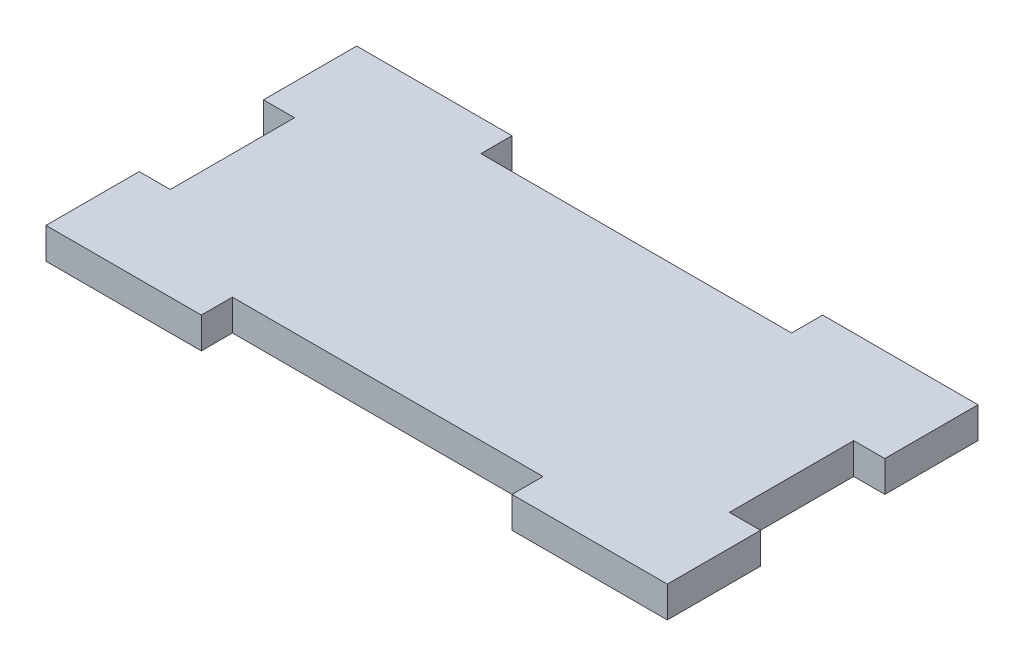
ISO-10303-21;
HEADER;
FILE_DESCRIPTION(('STEP AP214'),'2;1');
FILE_NAME('part.step','',(''),(''),'','','');
FILE_SCHEMA(('AUTOMOTIVE_DESIGN { 1 0 10303 214 1 1 1 1 }'));
ENDSEC;
DATA;
#1=APPLICATION_CONTEXT('core data for automotive mechanical design processes');
#2=APPLICATION_PROTOCOL_DEFINITION('international standard','automotive_design',2000,#1);
#3=PRODUCT_CONTEXT('',#1,'mechanical');
#4=PRODUCT('Part','Part','',(#3));
#5=PRODUCT_RELATED_PRODUCT_CATEGORY('part','',(#4));
#6=PRODUCT_DEFINITION_FORMATION('','',#4);
#7=PRODUCT_DEFINITION_CONTEXT('part definition',#1,'design');
#8=PRODUCT_DEFINITION('design','',#6,#7);
#9=PRODUCT_DEFINITION_SHAPE('','',#8);
#10=(LENGTH_UNIT() NAMED_UNIT(*) SI_UNIT(.MILLI.,.METRE.));
#11=(NAMED_UNIT(*) PLANE_ANGLE_UNIT() SI_UNIT($,.RADIAN.));
#12=(NAMED_UNIT(*) SI_UNIT($,.STERADIAN.) SOLID_ANGLE_UNIT());
#13=UNCERTAINTY_MEASURE_WITH_UNIT(LENGTH_MEASURE(1.E-05),#10,'distance_accuracy_value','');
#14=(GEOMETRIC_REPRESENTATION_CONTEXT(3) GLOBAL_UNCERTAINTY_ASSIGNED_CONTEXT((#13)) GLOBAL_UNIT_ASSIGNED_CONTEXT((#10,
#11,#12)) REPRESENTATION_CONTEXT('',''));
#15=CARTESIAN_POINT('',(0.,0.,0.));
#16=DIRECTION('',(0.,0.,1.));
#17=DIRECTION('',(1.,0.,0.));
#18=AXIS2_PLACEMENT_3D('',#15,#16,#17);
#19=CARTESIAN_POINT('',(50.,5.,9.01524638057237));
#20=DIRECTION('',(-1.,0.,0.));
#21=DIRECTION('',(0.,0.,1.));
#22=AXIS2_PLACEMENT_3D('',#19,#20,#21);
#23=PLANE('',#22);
#24=DIRECTION('',(0.,0.,-1.));
#25=VECTOR('',#24,1.);
#26=CARTESIAN_POINT('',(50.,0.,9.01524638057237));
#27=LINE('',#26,#25);
#28=CARTESIAN_POINT('',(50.,0.,24.0152463805724));
#29=VERTEX_POINT('',#28);
#30=CARTESIAN_POINT('',(50.,0.,9.01524638057237));
#31=VERTEX_POINT('',#30);
#32=EDGE_CURVE('E214',#29,#31,#27,.T.);
#33=ORIENTED_EDGE('',*,*,#32,.T.);
#34=DIRECTION('',(0.,-1.,0.));
#35=VECTOR('',#34,1.);
#36=CARTESIAN_POINT('',(50.,5.,9.01524638057237));
#37=LINE('',#36,#35);
#38=CARTESIAN_POINT('',(50.,5.,9.01524638057237));
#39=VERTEX_POINT('',#38);
#40=EDGE_CURVE('E11',#39,#31,#37,.T.);
#41=ORIENTED_EDGE('',*,*,#40,.F.);
#42=DIRECTION('',(0.,0.,-1.));
#43=VECTOR('',#42,1.);
#44=CARTESIAN_POINT('',(50.,5.,9.01524638057237));
#45=LINE('',#44,#43);
#46=CARTESIAN_POINT('',(50.,5.,24.0152463805724));
#47=VERTEX_POINT('',#46);
#48=EDGE_CURVE('E272',#47,#39,#45,.T.);
#49=ORIENTED_EDGE('',*,*,#48,.F.);
#50=DIRECTION('',(0.,-1.,0.));
#51=VECTOR('',#50,1.);
#52=CARTESIAN_POINT('',(50.,5.,24.0152463805724));
#53=LINE('',#52,#51);
#54=EDGE_CURVE('E210',#47,#29,#53,.T.);
#55=ORIENTED_EDGE('',*,*,#54,.T.);
#56=EDGE_LOOP('',(#33,#41,#49,#55));
#57=FACE_BOUND('',#56,.T.);
#58=ADVANCED_FACE('F41',(#57),#23,.F.);
#59=CARTESIAN_POINT('',(45.,5.,9.01524638057237));
#60=DIRECTION('',(0.,0.,1.));
#61=DIRECTION('',(1.,0.,0.));
#62=AXIS2_PLACEMENT_3D('',#59,#60,#61);
#63=PLANE('',#62);
#64=DIRECTION('',(-1.,0.,0.));
#65=VECTOR('',#64,1.);
#66=CARTESIAN_POINT('',(45.,0.,9.01524638057237));
#67=LINE('',#66,#65);
#68=CARTESIAN_POINT('',(45.,0.,9.01524638057237));
#69=VERTEX_POINT('',#68);
#70=EDGE_CURVE('E218',#31,#69,#67,.T.);
#71=ORIENTED_EDGE('',*,*,#70,.T.);
#72=DIRECTION('',(0.,-1.,0.));
#73=VECTOR('',#72,1.);
#74=CARTESIAN_POINT('',(45.,5.,9.01524638057237));
#75=LINE('',#74,#73);
#76=CARTESIAN_POINT('',(45.,5.,9.01524638057237));
#77=VERTEX_POINT('',#76);
#78=EDGE_CURVE('E50',#77,#69,#75,.T.);
#79=ORIENTED_EDGE('',*,*,#78,.F.);
#80=DIRECTION('',(-1.,0.,0.));
#81=VECTOR('',#80,1.);
#82=CARTESIAN_POINT('',(45.,5.,9.01524638057237));
#83=LINE('',#82,#81);
#84=EDGE_CURVE('E137',#39,#77,#83,.T.);
#85=ORIENTED_EDGE('',*,*,#84,.F.);
#86=ORIENTED_EDGE('',*,*,#40,.T.);
#87=EDGE_LOOP('',(#71,#79,#85,#86));
#88=FACE_BOUND('',#87,.T.);
#89=ADVANCED_FACE('F422',(#88),#63,.F.);
#90=CARTESIAN_POINT('',(45.,5.,-10.9847536194276));
#91=DIRECTION('',(-1.,0.,0.));
#92=DIRECTION('',(0.,0.,1.));
#93=AXIS2_PLACEMENT_3D('',#90,#91,#92);
#94=PLANE('',#93);
#95=DIRECTION('',(0.,0.,-1.));
#96=VECTOR('',#95,1.);
#97=CARTESIAN_POINT('',(45.,0.,-10.9847536194276));
#98=LINE('',#97,#96);
#99=CARTESIAN_POINT('',(45.,0.,-10.9847536194276));
#100=VERTEX_POINT('',#99);
#101=EDGE_CURVE('E221',#69,#100,#98,.T.);
#102=ORIENTED_EDGE('',*,*,#101,.T.);
#103=DIRECTION('',(0.,-1.,0.));
#104=VECTOR('',#103,1.);
#105=CARTESIAN_POINT('',(45.,5.,-10.9847536194276));
#106=LINE('',#105,#104);
#107=CARTESIAN_POINT('',(45.,5.,-10.9847536194276));
#108=VERTEX_POINT('',#107);
#109=EDGE_CURVE('E331',#108,#100,#106,.T.);
#110=ORIENTED_EDGE('',*,*,#109,.F.);
#111=DIRECTION('',(0.,0.,-1.));
#112=VECTOR('',#111,1.);
#113=CARTESIAN_POINT('',(45.,5.,-10.9847536194276));
#114=LINE('',#113,#112);
#115=EDGE_CURVE('E341',#77,#108,#114,.T.);
#116=ORIENTED_EDGE('',*,*,#115,.F.);
#117=ORIENTED_EDGE('',*,*,#78,.T.);
#118=EDGE_LOOP('',(#102,#110,#116,#117));
#119=FACE_BOUND('',#118,.T.);
#120=ADVANCED_FACE('F339',(#119),#94,.F.);
#121=CARTESIAN_POINT('',(50.,5.,-10.9847536194276));
#122=DIRECTION('',(0.,0.,-1.));
#123=DIRECTION('',(-1.,0.,0.));
#124=AXIS2_PLACEMENT_3D('',#121,#122,#123);
#125=PLANE('',#124);
#126=DIRECTION('',(1.,0.,0.));
#127=VECTOR('',#126,1.);
#128=CARTESIAN_POINT('',(50.,0.,-10.9847536194276));
#129=LINE('',#128,#127);
#130=CARTESIAN_POINT('',(50.,0.,-10.9847536194276));
#131=VERTEX_POINT('',#130);
#132=EDGE_CURVE('E224',#100,#131,#129,.T.);
#133=ORIENTED_EDGE('',*,*,#132,.T.);
#134=DIRECTION('',(0.,-1.,0.));
#135=VECTOR('',#134,1.);
#136=CARTESIAN_POINT('',(50.,5.,-10.9847536194276));
#137=LINE('',#136,#135);
#138=CARTESIAN_POINT('',(50.,5.,-10.9847536194276));
#139=VERTEX_POINT('',#138);
#140=EDGE_CURVE('E327',#139,#131,#137,.T.);
#141=ORIENTED_EDGE('',*,*,#140,.F.);
#142=DIRECTION('',(1.,0.,0.));
#143=VECTOR('',#142,1.);
#144=CARTESIAN_POINT('',(50.,5.,-10.9847536194276));
#145=LINE('',#144,#143);
#146=EDGE_CURVE('E360',#108,#139,#145,.T.);
#147=ORIENTED_EDGE('',*,*,#146,.F.);
#148=ORIENTED_EDGE('',*,*,#109,.T.);
#149=EDGE_LOOP('',(#133,#141,#147,#148));
#150=FACE_BOUND('',#149,.T.);
#151=ADVANCED_FACE('F350',(#150),#125,.F.);
#152=CARTESIAN_POINT('',(50.,5.,-25.9847536194276));
#153=DIRECTION('',(-1.,0.,0.));
#154=DIRECTION('',(0.,0.,1.));
#155=AXIS2_PLACEMENT_3D('',#152,#153,#154);
#156=PLANE('',#155);
#157=DIRECTION('',(0.,0.,-1.));
#158=VECTOR('',#157,1.);
#159=CARTESIAN_POINT('',(50.,0.,-25.9847536194276));
#160=LINE('',#159,#158);
#161=CARTESIAN_POINT('',(50.,0.,-25.9847536194276));
#162=VERTEX_POINT('',#161);
#163=EDGE_CURVE('E227',#131,#162,#160,.T.);
#164=ORIENTED_EDGE('',*,*,#163,.T.);
#165=DIRECTION('',(0.,-1.,0.));
#166=VECTOR('',#165,1.);
#167=CARTESIAN_POINT('',(50.,5.,-25.9847536194276));
#168=LINE('',#167,#166);
#169=CARTESIAN_POINT('',(50.,5.,-25.9847536194276));
#170=VERTEX_POINT('',#169);
#171=EDGE_CURVE('E323',#170,#162,#168,.T.);
#172=ORIENTED_EDGE('',*,*,#171,.F.);
#173=DIRECTION('',(0.,0.,-1.));
#174=VECTOR('',#173,1.);
#175=CARTESIAN_POINT('',(50.,5.,-25.9847536194276));
#176=LINE('',#175,#174);
#177=EDGE_CURVE('E356',#139,#170,#176,.T.);
#178=ORIENTED_EDGE('',*,*,#177,.F.);
#179=ORIENTED_EDGE('',*,*,#140,.T.);
#180=EDGE_LOOP('',(#164,#172,#178,#179));
#181=FACE_BOUND('',#180,.T.);
#182=ADVANCED_FACE('F354',(#181),#156,.F.);
#183=CARTESIAN_POINT('',(25.,5.,-25.9847536194276));
#184=DIRECTION('',(0.,0.,1.));
#185=DIRECTION('',(1.,0.,0.));
#186=AXIS2_PLACEMENT_3D('',#183,#184,#185);
#187=PLANE('',#186);
#188=DIRECTION('',(-1.,0.,0.));
#189=VECTOR('',#188,1.);
#190=CARTESIAN_POINT('',(25.,0.,-25.9847536194276));
#191=LINE('',#190,#189);
#192=CARTESIAN_POINT('',(25.,0.,-25.9847536194276));
#193=VERTEX_POINT('',#192);
#194=EDGE_CURVE('E230',#162,#193,#191,.T.);
#195=ORIENTED_EDGE('',*,*,#194,.T.);
#196=DIRECTION('',(0.,-1.,0.));
#197=VECTOR('',#196,1.);
#198=CARTESIAN_POINT('',(25.,5.,-25.9847536194276));
#199=LINE('',#198,#197);
#200=CARTESIAN_POINT('',(25.,5.,-25.9847536194276));
#201=VERTEX_POINT('',#200);
#202=EDGE_CURVE('E319',#201,#193,#199,.T.);
#203=ORIENTED_EDGE('',*,*,#202,.F.);
#204=DIRECTION('',(-1.,0.,0.));
#205=VECTOR('',#204,1.);
#206=CARTESIAN_POINT('',(25.,5.,-25.9847536194276));
#207=LINE('',#206,#205);
#208=EDGE_CURVE('E359',#170,#201,#207,.T.);
#209=ORIENTED_EDGE('',*,*,#208,.F.);
#210=ORIENTED_EDGE('',*,*,#171,.T.);
#211=EDGE_LOOP('',(#195,#203,#209,#210));
#212=FACE_BOUND('',#211,.T.);
#213=ADVANCED_FACE('F435',(#212),#187,.F.);
#214=CARTESIAN_POINT('',(25.,5.,-20.9847536194276));
#215=DIRECTION('',(1.,0.,0.));
#216=DIRECTION('',(0.,0.,-1.));
#217=AXIS2_PLACEMENT_3D('',#214,#215,#216);
#218=PLANE('',#217);
#219=DIRECTION('',(0.,0.,1.));
#220=VECTOR('',#219,1.);
#221=CARTESIAN_POINT('',(25.,0.,-20.9847536194276));
#222=LINE('',#221,#220);
#223=CARTESIAN_POINT('',(25.,0.,-20.9847536194276));
#224=VERTEX_POINT('',#223);
#225=EDGE_CURVE('E233',#193,#224,#222,.T.);
#226=ORIENTED_EDGE('',*,*,#225,.T.);
#227=DIRECTION('',(0.,-1.,0.));
#228=VECTOR('',#227,1.);
#229=CARTESIAN_POINT('',(25.,5.,-20.9847536194276));
#230=LINE('',#229,#228);
#231=CARTESIAN_POINT('',(25.,5.,-20.9847536194276));
#232=VERTEX_POINT('',#231);
#233=EDGE_CURVE('E315',#232,#224,#230,.T.);
#234=ORIENTED_EDGE('',*,*,#233,.F.);
#235=DIRECTION('',(0.,0.,1.));
#236=VECTOR('',#235,1.);
#237=CARTESIAN_POINT('',(25.,5.,-20.9847536194276));
#238=LINE('',#237,#236);
#239=EDGE_CURVE('E364',#201,#232,#238,.T.);
#240=ORIENTED_EDGE('',*,*,#239,.F.);
#241=ORIENTED_EDGE('',*,*,#202,.T.);
#242=EDGE_LOOP('',(#226,#234,#240,#241));
#243=FACE_BOUND('',#242,.T.);
#244=ADVANCED_FACE('F438',(#243),#218,.F.);
#245=CARTESIAN_POINT('',(-25.,5.,-20.9847536194276));
#246=DIRECTION('',(0.,0.,1.));
#247=DIRECTION('',(1.,0.,0.));
#248=AXIS2_PLACEMENT_3D('',#245,#246,#247);
#249=PLANE('',#248);
#250=DIRECTION('',(-1.,0.,0.));
#251=VECTOR('',#250,1.);
#252=CARTESIAN_POINT('',(-25.,0.,-20.9847536194276));
#253=LINE('',#252,#251);
#254=CARTESIAN_POINT('',(-25.,0.,-20.9847536194276));
#255=VERTEX_POINT('',#254);
#256=EDGE_CURVE('E236',#224,#255,#253,.T.);
#257=ORIENTED_EDGE('',*,*,#256,.T.);
#258=DIRECTION('',(0.,-1.,0.));
#259=VECTOR('',#258,1.);
#260=CARTESIAN_POINT('',(-25.,5.,-20.9847536194276));
#261=LINE('',#260,#259);
#262=CARTESIAN_POINT('',(-25.,5.,-20.9847536194276));
#263=VERTEX_POINT('',#262);
#264=EDGE_CURVE('E311',#263,#255,#261,.T.);
#265=ORIENTED_EDGE('',*,*,#264,.F.);
#266=DIRECTION('',(-1.,0.,0.));
#267=VECTOR('',#266,1.);
#268=CARTESIAN_POINT('',(-25.,5.,-20.9847536194276));
#269=LINE('',#268,#267);
#270=EDGE_CURVE('E371',#232,#263,#269,.T.);
#271=ORIENTED_EDGE('',*,*,#270,.F.);
#272=ORIENTED_EDGE('',*,*,#233,.T.);
#273=EDGE_LOOP('',(#257,#265,#271,#272));
#274=FACE_BOUND('',#273,.T.);
#275=ADVANCED_FACE('F442',(#274),#249,.F.);
#276=CARTESIAN_POINT('',(-25.,5.,-25.9847536194276));
#277=DIRECTION('',(-1.,0.,0.));
#278=DIRECTION('',(0.,0.,1.));
#279=AXIS2_PLACEMENT_3D('',#276,#277,#278);
#280=PLANE('',#279);
#281=DIRECTION('',(0.,0.,-1.));
#282=VECTOR('',#281,1.);
#283=CARTESIAN_POINT('',(-25.,0.,-25.9847536194276));
#284=LINE('',#283,#282);
#285=CARTESIAN_POINT('',(-25.,0.,-25.9847536194276));
#286=VERTEX_POINT('',#285);
#287=EDGE_CURVE('E239',#255,#286,#284,.T.);
#288=ORIENTED_EDGE('',*,*,#287,.T.);
#289=DIRECTION('',(0.,-1.,0.));
#290=VECTOR('',#289,1.);
#291=CARTESIAN_POINT('',(-25.,5.,-25.9847536194276));
#292=LINE('',#291,#290);
#293=CARTESIAN_POINT('',(-25.,5.,-25.9847536194276));
#294=VERTEX_POINT('',#293);
#295=EDGE_CURVE('E307',#294,#286,#292,.T.);
#296=ORIENTED_EDGE('',*,*,#295,.F.);
#297=DIRECTION('',(0.,0.,-1.));
#298=VECTOR('',#297,1.);
#299=CARTESIAN_POINT('',(-25.,5.,-25.9847536194276));
#300=LINE('',#299,#298);
#301=EDGE_CURVE('E374',#263,#294,#300,.T.);
#302=ORIENTED_EDGE('',*,*,#301,.F.);
#303=ORIENTED_EDGE('',*,*,#264,.T.);
#304=EDGE_LOOP('',(#288,#296,#302,#303));
#305=FACE_BOUND('',#304,.T.);
#306=ADVANCED_FACE('F446',(#305),#280,.F.);
#307=CARTESIAN_POINT('',(-50.,5.,-25.9847536194276));
#308=DIRECTION('',(0.,0.,1.));
#309=DIRECTION('',(1.,0.,0.));
#310=AXIS2_PLACEMENT_3D('',#307,#308,#309);
#311=PLANE('',#310);
#312=DIRECTION('',(-1.,0.,0.));
#313=VECTOR('',#312,1.);
#314=CARTESIAN_POINT('',(-50.,0.,-25.9847536194276));
#315=LINE('',#314,#313);
#316=CARTESIAN_POINT('',(-50.,0.,-25.9847536194276));
#317=VERTEX_POINT('',#316);
#318=EDGE_CURVE('E242',#286,#317,#315,.T.);
#319=ORIENTED_EDGE('',*,*,#318,.T.);
#320=DIRECTION('',(0.,-1.,0.));
#321=VECTOR('',#320,1.);
#322=CARTESIAN_POINT('',(-50.,5.,-25.9847536194276));
#323=LINE('',#322,#321);
#324=CARTESIAN_POINT('',(-50.,5.,-25.9847536194276));
#325=VERTEX_POINT('',#324);
#326=EDGE_CURVE('E303',#325,#317,#323,.T.);
#327=ORIENTED_EDGE('',*,*,#326,.F.);
#328=DIRECTION('',(-1.,0.,0.));
#329=VECTOR('',#328,1.);
#330=CARTESIAN_POINT('',(-50.,5.,-25.9847536194276));
#331=LINE('',#330,#329);
#332=EDGE_CURVE('E377',#294,#325,#331,.T.);
#333=ORIENTED_EDGE('',*,*,#332,.F.);
#334=ORIENTED_EDGE('',*,*,#295,.T.);
#335=EDGE_LOOP('',(#319,#327,#333,#334));
#336=FACE_BOUND('',#335,.T.);
#337=ADVANCED_FACE('F450',(#336),#311,.F.);
#338=CARTESIAN_POINT('',(-50.,5.,-25.9847536194276));
#339=DIRECTION('',(1.,0.,0.));
#340=DIRECTION('',(0.,0.,-1.));
#341=AXIS2_PLACEMENT_3D('',#338,#339,#340);
#342=PLANE('',#341);
#343=DIRECTION('',(0.,0.,1.));
#344=VECTOR('',#343,1.);
#345=CARTESIAN_POINT('',(-50.,0.,-25.9847536194276));
#346=LINE('',#345,#344);
#347=CARTESIAN_POINT('',(-50.,0.,-10.9847536194276));
#348=VERTEX_POINT('',#347);
#349=EDGE_CURVE('E245',#317,#348,#346,.T.);
#350=ORIENTED_EDGE('',*,*,#349,.T.);
#351=DIRECTION('',(0.,-1.,0.));
#352=VECTOR('',#351,1.);
#353=CARTESIAN_POINT('',(-50.,5.,-10.9847536194276));
#354=LINE('',#353,#352);
#355=CARTESIAN_POINT('',(-50.,5.,-10.9847536194276));
#356=VERTEX_POINT('',#355);
#357=EDGE_CURVE('E299',#356,#348,#354,.T.);
#358=ORIENTED_EDGE('',*,*,#357,.F.);
#359=DIRECTION('',(0.,0.,1.));
#360=VECTOR('',#359,1.);
#361=CARTESIAN_POINT('',(-50.,5.,-25.9847536194276));
#362=LINE('',#361,#360);
#363=EDGE_CURVE('E380',#325,#356,#362,.T.);
#364=ORIENTED_EDGE('',*,*,#363,.F.);
#365=ORIENTED_EDGE('',*,*,#326,.T.);
#366=EDGE_LOOP('',(#350,#358,#364,#365));
#367=FACE_BOUND('',#366,.T.);
#368=ADVANCED_FACE('F454',(#367),#342,.F.);
#369=CARTESIAN_POINT('',(-50.,5.,-10.9847536194276));
#370=DIRECTION('',(0.,0.,-1.));
#371=DIRECTION('',(-1.,0.,0.));
#372=AXIS2_PLACEMENT_3D('',#369,#370,#371);
#373=PLANE('',#372);
#374=DIRECTION('',(1.,0.,0.));
#375=VECTOR('',#374,1.);
#376=CARTESIAN_POINT('',(-50.,0.,-10.9847536194276));
#377=LINE('',#376,#375);
#378=CARTESIAN_POINT('',(-45.,0.,-10.9847536194276));
#379=VERTEX_POINT('',#378);
#380=EDGE_CURVE('E248',#348,#379,#377,.T.);
#381=ORIENTED_EDGE('',*,*,#380,.T.);
#382=DIRECTION('',(0.,-1.,0.));
#383=VECTOR('',#382,1.);
#384=CARTESIAN_POINT('',(-45.,5.,-10.9847536194276));
#385=LINE('',#384,#383);
#386=CARTESIAN_POINT('',(-45.,5.,-10.9847536194276));
#387=VERTEX_POINT('',#386);
#388=EDGE_CURVE('E295',#387,#379,#385,.T.);
#389=ORIENTED_EDGE('',*,*,#388,.F.);
#390=DIRECTION('',(1.,0.,0.));
#391=VECTOR('',#390,1.);
#392=CARTESIAN_POINT('',(-50.,5.,-10.9847536194276));
#393=LINE('',#392,#391);
#394=EDGE_CURVE('E383',#356,#387,#393,.T.);
#395=ORIENTED_EDGE('',*,*,#394,.F.);
#396=ORIENTED_EDGE('',*,*,#357,.T.);
#397=EDGE_LOOP('',(#381,#389,#395,#396));
#398=FACE_BOUND('',#397,.T.);
#399=ADVANCED_FACE('F458',(#398),#373,.F.);
#400=CARTESIAN_POINT('',(-45.,5.,-10.9847536194276));
#401=DIRECTION('',(1.,0.,0.));
#402=DIRECTION('',(0.,0.,-1.));
#403=AXIS2_PLACEMENT_3D('',#400,#401,#402);
#404=PLANE('',#403);
#405=DIRECTION('',(0.,0.,1.));
#406=VECTOR('',#405,1.);
#407=CARTESIAN_POINT('',(-45.,0.,-10.9847536194276));
#408=LINE('',#407,#406);
#409=CARTESIAN_POINT('',(-45.,0.,9.01524638057239));
#410=VERTEX_POINT('',#409);
#411=EDGE_CURVE('E251',#379,#410,#408,.T.);
#412=ORIENTED_EDGE('',*,*,#411,.T.);
#413=DIRECTION('',(0.,-1.,0.));
#414=VECTOR('',#413,1.);
#415=CARTESIAN_POINT('',(-45.,5.,9.01524638057239));
#416=LINE('',#415,#414);
#417=CARTESIAN_POINT('',(-45.,5.,9.01524638057239));
#418=VERTEX_POINT('',#417);
#419=EDGE_CURVE('E291',#418,#410,#416,.T.);
#420=ORIENTED_EDGE('',*,*,#419,.F.);
#421=DIRECTION('',(0.,0.,1.));
#422=VECTOR('',#421,1.);
#423=CARTESIAN_POINT('',(-45.,5.,-10.9847536194276));
#424=LINE('',#423,#422);
#425=EDGE_CURVE('E386',#387,#418,#424,.T.);
#426=ORIENTED_EDGE('',*,*,#425,.F.);
#427=ORIENTED_EDGE('',*,*,#388,.T.);
#428=EDGE_LOOP('',(#412,#420,#426,#427));
#429=FACE_BOUND('',#428,.T.);
#430=ADVANCED_FACE('F462',(#429),#404,.F.);
#431=CARTESIAN_POINT('',(-45.,5.,9.01524638057239));
#432=DIRECTION('',(0.,0.,1.));
#433=DIRECTION('',(1.,0.,0.));
#434=AXIS2_PLACEMENT_3D('',#431,#432,#433);
#435=PLANE('',#434);
#436=DIRECTION('',(-1.,0.,0.));
#437=VECTOR('',#436,1.);
#438=CARTESIAN_POINT('',(-45.,0.,9.01524638057239));
#439=LINE('',#438,#437);
#440=CARTESIAN_POINT('',(-50.,0.,9.01524638057239));
#441=VERTEX_POINT('',#440);
#442=EDGE_CURVE('E254',#410,#441,#439,.T.);
#443=ORIENTED_EDGE('',*,*,#442,.T.);
#444=DIRECTION('',(0.,-1.,0.));
#445=VECTOR('',#444,1.);
#446=CARTESIAN_POINT('',(-50.,5.,9.01524638057239));
#447=LINE('',#446,#445);
#448=CARTESIAN_POINT('',(-50.,5.,9.01524638057239));
#449=VERTEX_POINT('',#448);
#450=EDGE_CURVE('E287',#449,#441,#447,.T.);
#451=ORIENTED_EDGE('',*,*,#450,.F.);
#452=DIRECTION('',(-1.,0.,0.));
#453=VECTOR('',#452,1.);
#454=CARTESIAN_POINT('',(-45.,5.,9.01524638057239));
#455=LINE('',#454,#453);
#456=EDGE_CURVE('E389',#418,#449,#455,.T.);
#457=ORIENTED_EDGE('',*,*,#456,.F.);
#458=ORIENTED_EDGE('',*,*,#419,.T.);
#459=EDGE_LOOP('',(#443,#451,#457,#458));
#460=FACE_BOUND('',#459,.T.);
#461=ADVANCED_FACE('F466',(#460),#435,.F.);
#462=CARTESIAN_POINT('',(-50.,5.,9.01524638057239));
#463=DIRECTION('',(1.,0.,0.));
#464=DIRECTION('',(0.,0.,-1.));
#465=AXIS2_PLACEMENT_3D('',#462,#463,#464);
#466=PLANE('',#465);
#467=DIRECTION('',(0.,0.,1.));
#468=VECTOR('',#467,1.);
#469=CARTESIAN_POINT('',(-50.,0.,9.01524638057239));
#470=LINE('',#469,#468);
#471=CARTESIAN_POINT('',(-50.,0.,24.0152463805724));
#472=VERTEX_POINT('',#471);
#473=EDGE_CURVE('E257',#441,#472,#470,.T.);
#474=ORIENTED_EDGE('',*,*,#473,.T.);
#475=DIRECTION('',(0.,-1.,0.));
#476=VECTOR('',#475,1.);
#477=CARTESIAN_POINT('',(-50.,5.,24.0152463805724));
#478=LINE('',#477,#476);
#479=CARTESIAN_POINT('',(-50.,5.,24.0152463805724));
#480=VERTEX_POINT('',#479);
#481=EDGE_CURVE('E283',#480,#472,#478,.T.);
#482=ORIENTED_EDGE('',*,*,#481,.F.);
#483=DIRECTION('',(0.,0.,1.));
#484=VECTOR('',#483,1.);
#485=CARTESIAN_POINT('',(-50.,5.,9.01524638057239));
#486=LINE('',#485,#484);
#487=EDGE_CURVE('E392',#449,#480,#486,.T.);
#488=ORIENTED_EDGE('',*,*,#487,.F.);
#489=ORIENTED_EDGE('',*,*,#450,.T.);
#490=EDGE_LOOP('',(#474,#482,#488,#489));
#491=FACE_BOUND('',#490,.T.);
#492=ADVANCED_FACE('F470',(#491),#466,.F.);
#493=CARTESIAN_POINT('',(-50.,5.,24.0152463805724));
#494=DIRECTION('',(0.,0.,-1.));
#495=DIRECTION('',(-1.,0.,0.));
#496=AXIS2_PLACEMENT_3D('',#493,#494,#495);
#497=PLANE('',#496);
#498=DIRECTION('',(1.,0.,0.));
#499=VECTOR('',#498,1.);
#500=CARTESIAN_POINT('',(-50.,0.,24.0152463805724));
#501=LINE('',#500,#499);
#502=CARTESIAN_POINT('',(-25.,0.,24.0152463805724));
#503=VERTEX_POINT('',#502);
#504=EDGE_CURVE('E260',#472,#503,#501,.T.);
#505=ORIENTED_EDGE('',*,*,#504,.T.);
#506=DIRECTION('',(0.,-1.,0.));
#507=VECTOR('',#506,1.);
#508=CARTESIAN_POINT('',(-25.,5.,24.0152463805724));
#509=LINE('',#508,#507);
#510=CARTESIAN_POINT('',(-25.,5.,24.0152463805724));
#511=VERTEX_POINT('',#510);
#512=EDGE_CURVE('E279',#511,#503,#509,.T.);
#513=ORIENTED_EDGE('',*,*,#512,.F.);
#514=DIRECTION('',(1.,0.,0.));
#515=VECTOR('',#514,1.);
#516=CARTESIAN_POINT('',(-50.,5.,24.0152463805724));
#517=LINE('',#516,#515);
#518=EDGE_CURVE('E395',#480,#511,#517,.T.);
#519=ORIENTED_EDGE('',*,*,#518,.F.);
#520=ORIENTED_EDGE('',*,*,#481,.T.);
#521=EDGE_LOOP('',(#505,#513,#519,#520));
#522=FACE_BOUND('',#521,.T.);
#523=ADVANCED_FACE('F403',(#522),#497,.F.);
#524=CARTESIAN_POINT('',(-25.,5.,24.0152463805724));
#525=DIRECTION('',(-1.,0.,0.));
#526=DIRECTION('',(0.,0.,1.));
#527=AXIS2_PLACEMENT_3D('',#524,#525,#526);
#528=PLANE('',#527);
#529=DIRECTION('',(0.,0.,-1.));
#530=VECTOR('',#529,1.);
#531=CARTESIAN_POINT('',(-25.,0.,24.0152463805724));
#532=LINE('',#531,#530);
#533=CARTESIAN_POINT('',(-25.,0.,19.0152463805724));
#534=VERTEX_POINT('',#533);
#535=EDGE_CURVE('E263',#503,#534,#532,.T.);
#536=ORIENTED_EDGE('',*,*,#535,.T.);
#537=DIRECTION('',(0.,-1.,0.));
#538=VECTOR('',#537,1.);
#539=CARTESIAN_POINT('',(-25.,5.,19.0152463805724));
#540=LINE('',#539,#538);
#541=CARTESIAN_POINT('',(-25.,5.,19.0152463805724));
#542=VERTEX_POINT('',#541);
#543=EDGE_CURVE('E203',#542,#534,#540,.T.);
#544=ORIENTED_EDGE('',*,*,#543,.F.);
#545=DIRECTION('',(0.,0.,-1.));
#546=VECTOR('',#545,1.);
#547=CARTESIAN_POINT('',(-25.,5.,24.0152463805724));
#548=LINE('',#547,#546);
#549=EDGE_CURVE('E192',#511,#542,#548,.T.);
#550=ORIENTED_EDGE('',*,*,#549,.F.);
#551=ORIENTED_EDGE('',*,*,#512,.T.);
#552=EDGE_LOOP('',(#536,#544,#550,#551));
#553=FACE_BOUND('',#552,.T.);
#554=ADVANCED_FACE('F407',(#553),#528,.F.);
#555=CARTESIAN_POINT('',(-25.,5.,19.0152463805724));
#556=DIRECTION('',(0.,0.,-1.));
#557=DIRECTION('',(-1.,0.,0.));
#558=AXIS2_PLACEMENT_3D('',#555,#556,#557);
#559=PLANE('',#558);
#560=DIRECTION('',(1.,0.,0.));
#561=VECTOR('',#560,1.);
#562=CARTESIAN_POINT('',(-25.,0.,19.0152463805724));
#563=LINE('',#562,#561);
#564=CARTESIAN_POINT('',(25.,0.,19.0152463805724));
#565=VERTEX_POINT('',#564);
#566=EDGE_CURVE('E201',#534,#565,#563,.T.);
#567=ORIENTED_EDGE('',*,*,#566,.T.);
#568=DIRECTION('',(0.,-1.,0.));
#569=VECTOR('',#568,1.);
#570=CARTESIAN_POINT('',(25.,5.,19.0152463805724));
#571=LINE('',#570,#569);
#572=CARTESIAN_POINT('',(25.,5.,19.0152463805724));
#573=VERTEX_POINT('',#572);
#574=EDGE_CURVE('E198',#573,#565,#571,.T.);
#575=ORIENTED_EDGE('',*,*,#574,.F.);
#576=DIRECTION('',(1.,0.,0.));
#577=VECTOR('',#576,1.);
#578=CARTESIAN_POINT('',(-25.,5.,19.0152463805724));
#579=LINE('',#578,#577);
#580=EDGE_CURVE('E186',#542,#573,#579,.T.);
#581=ORIENTED_EDGE('',*,*,#580,.F.);
#582=ORIENTED_EDGE('',*,*,#543,.T.);
#583=EDGE_LOOP('',(#567,#575,#581,#582));
#584=FACE_BOUND('',#583,.T.);
#585=ADVANCED_FACE('F199',(#584),#559,.F.);
#586=CARTESIAN_POINT('',(25.,5.,19.0152463805724));
#587=DIRECTION('',(1.,0.,0.));
#588=DIRECTION('',(0.,0.,-1.));
#589=AXIS2_PLACEMENT_3D('',#586,#587,#588);
#590=PLANE('',#589);
#591=DIRECTION('',(0.,0.,1.));
#592=VECTOR('',#591,1.);
#593=CARTESIAN_POINT('',(25.,0.,19.0152463805724));
#594=LINE('',#593,#592);
#595=CARTESIAN_POINT('',(25.,0.,24.0152463805724));
#596=VERTEX_POINT('',#595);
#597=EDGE_CURVE('E123',#565,#596,#594,.T.);
#598=ORIENTED_EDGE('',*,*,#597,.T.);
#599=DIRECTION('',(0.,-1.,0.));
#600=VECTOR('',#599,1.);
#601=CARTESIAN_POINT('',(25.,5.,24.0152463805724));
#602=LINE('',#601,#600);
#603=CARTESIAN_POINT('',(25.,5.,24.0152463805724));
#604=VERTEX_POINT('',#603);
#605=EDGE_CURVE('E204',#604,#596,#602,.T.);
#606=ORIENTED_EDGE('',*,*,#605,.F.);
#607=DIRECTION('',(0.,0.,1.));
#608=VECTOR('',#607,1.);
#609=CARTESIAN_POINT('',(25.,5.,19.0152463805724));
#610=LINE('',#609,#608);
#611=EDGE_CURVE('E190',#573,#604,#610,.T.);
#612=ORIENTED_EDGE('',*,*,#611,.F.);
#613=ORIENTED_EDGE('',*,*,#574,.T.);
#614=EDGE_LOOP('',(#598,#606,#612,#613));
#615=FACE_BOUND('',#614,.T.);
#616=ADVANCED_FACE('F206',(#615),#590,.F.);
#617=CARTESIAN_POINT('',(25.,5.,24.0152463805724));
#618=DIRECTION('',(0.,0.,-1.));
#619=DIRECTION('',(-1.,0.,0.));
#620=AXIS2_PLACEMENT_3D('',#617,#618,#619);
#621=PLANE('',#620);
#622=DIRECTION('',(1.,0.,0.));
#623=VECTOR('',#622,1.);
#624=CARTESIAN_POINT('',(25.,0.,24.0152463805724));
#625=LINE('',#624,#623);
#626=EDGE_CURVE('E129',#596,#29,#625,.T.);
#627=ORIENTED_EDGE('',*,*,#626,.T.);
#628=ORIENTED_EDGE('',*,*,#54,.F.);
#629=DIRECTION('',(1.,0.,0.));
#630=VECTOR('',#629,1.);
#631=CARTESIAN_POINT('',(25.,5.,24.0152463805724));
#632=LINE('',#631,#630);
#633=EDGE_CURVE('E58',#604,#47,#632,.T.);
#634=ORIENTED_EDGE('',*,*,#633,.F.);
#635=ORIENTED_EDGE('',*,*,#605,.T.);
#636=EDGE_LOOP('',(#627,#628,#634,#635));
#637=FACE_BOUND('',#636,.T.);
#638=ADVANCED_FACE('F411',(#637),#621,.F.);
#639=CARTESIAN_POINT('',(0.,5.,0.));
#640=DIRECTION('',(0.,1.,0.));
#641=DIRECTION('',(0.,0.,1.));
#642=AXIS2_PLACEMENT_3D('',#639,#640,#641);
#643=PLANE('',#642);
#644=ORIENTED_EDGE('',*,*,#48,.T.);
#645=ORIENTED_EDGE('',*,*,#84,.T.);
#646=ORIENTED_EDGE('',*,*,#115,.T.);
#647=ORIENTED_EDGE('',*,*,#146,.T.);
#648=ORIENTED_EDGE('',*,*,#177,.T.);
#649=ORIENTED_EDGE('',*,*,#208,.T.);
#650=ORIENTED_EDGE('',*,*,#239,.T.);
#651=ORIENTED_EDGE('',*,*,#270,.T.);
#652=ORIENTED_EDGE('',*,*,#301,.T.);
#653=ORIENTED_EDGE('',*,*,#332,.T.);
#654=ORIENTED_EDGE('',*,*,#363,.T.);
#655=ORIENTED_EDGE('',*,*,#394,.T.);
#656=ORIENTED_EDGE('',*,*,#425,.T.);
#657=ORIENTED_EDGE('',*,*,#456,.T.);
#658=ORIENTED_EDGE('',*,*,#487,.T.);
#659=ORIENTED_EDGE('',*,*,#518,.T.);
#660=ORIENTED_EDGE('',*,*,#549,.T.);
#661=ORIENTED_EDGE('',*,*,#580,.T.);
#662=ORIENTED_EDGE('',*,*,#611,.T.);
#663=ORIENTED_EDGE('',*,*,#633,.T.);
#664=EDGE_LOOP('',(#644,#645,#646,#647,#648,#649,#650,#651,#652,#653,#654,#655,#656,#657,#658,
#659,#660,#661,#662,#663));
#665=FACE_BOUND('',#664,.T.);
#666=ADVANCED_FACE('F188',(#665),#643,.T.);
#667=CARTESIAN_POINT('',(0.,0.,0.));
#668=DIRECTION('',(0.,1.,0.));
#669=DIRECTION('',(0.,0.,1.));
#670=AXIS2_PLACEMENT_3D('',#667,#668,#669);
#671=PLANE('',#670);
#672=ORIENTED_EDGE('',*,*,#32,.F.);
#673=ORIENTED_EDGE('',*,*,#626,.F.);
#674=ORIENTED_EDGE('',*,*,#597,.F.);
#675=ORIENTED_EDGE('',*,*,#566,.F.);
#676=ORIENTED_EDGE('',*,*,#535,.F.);
#677=ORIENTED_EDGE('',*,*,#504,.F.);
#678=ORIENTED_EDGE('',*,*,#473,.F.);
#679=ORIENTED_EDGE('',*,*,#442,.F.);
#680=ORIENTED_EDGE('',*,*,#411,.F.);
#681=ORIENTED_EDGE('',*,*,#380,.F.);
#682=ORIENTED_EDGE('',*,*,#349,.F.);
#683=ORIENTED_EDGE('',*,*,#318,.F.);
#684=ORIENTED_EDGE('',*,*,#287,.F.);
#685=ORIENTED_EDGE('',*,*,#256,.F.);
#686=ORIENTED_EDGE('',*,*,#225,.F.);
#687=ORIENTED_EDGE('',*,*,#194,.F.);
#688=ORIENTED_EDGE('',*,*,#163,.F.);
#689=ORIENTED_EDGE('',*,*,#132,.F.);
#690=ORIENTED_EDGE('',*,*,#101,.F.);
#691=ORIENTED_EDGE('',*,*,#70,.F.);
#692=EDGE_LOOP('',(#672,#673,#674,#675,#676,#677,#678,#679,#680,#681,#682,#683,#684,#685,#686,
#687,#688,#689,#690,#691));
#693=FACE_BOUND('',#692,.T.);
#694=ADVANCED_FACE('F345',(#693),#671,.F.);
#695=CLOSED_SHELL('',(#58,#89,#120,#151,#182,#213,#244,#275,#306,#337,#368,#399,#430,#461,#492,
#523,#554,#585,#616,#638,#666,#694));
#696=MANIFOLD_SOLID_BREP('B2',#695);
#697=ADVANCED_BREP_SHAPE_REPRESENTATION('',(#18,#696),#14);
#698=SHAPE_DEFINITION_REPRESENTATION(#9,#697);
ENDSEC;
END-ISO-10303-21;
